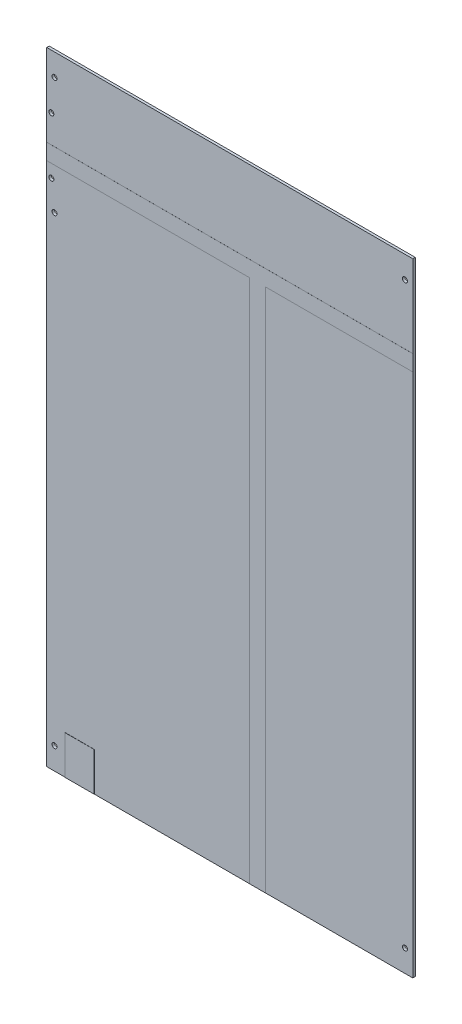
ISO-10303-21;
HEADER;
FILE_DESCRIPTION(('STEP AP214'),'2;1');
FILE_NAME('part.step','',(''),(''),'','','');
FILE_SCHEMA(('AUTOMOTIVE_DESIGN { 1 0 10303 214 1 1 1 1 }'));
ENDSEC;
DATA;
#1=APPLICATION_CONTEXT('core data for automotive mechanical design processes');
#2=APPLICATION_PROTOCOL_DEFINITION('international standard','automotive_design',2000,#1);
#3=PRODUCT_CONTEXT('',#1,'mechanical');
#4=PRODUCT('Part','Part','',(#3));
#5=PRODUCT_RELATED_PRODUCT_CATEGORY('part','',(#4));
#6=PRODUCT_DEFINITION_FORMATION('','',#4);
#7=PRODUCT_DEFINITION_CONTEXT('part definition',#1,'design');
#8=PRODUCT_DEFINITION('design','',#6,#7);
#9=PRODUCT_DEFINITION_SHAPE('','',#8);
#10=(LENGTH_UNIT() NAMED_UNIT(*) SI_UNIT(.MILLI.,.METRE.));
#11=(NAMED_UNIT(*) PLANE_ANGLE_UNIT() SI_UNIT($,.RADIAN.));
#12=(NAMED_UNIT(*) SI_UNIT($,.STERADIAN.) SOLID_ANGLE_UNIT());
#13=UNCERTAINTY_MEASURE_WITH_UNIT(LENGTH_MEASURE(1.E-05),#10,'distance_accuracy_value','');
#14=(GEOMETRIC_REPRESENTATION_CONTEXT(3) GLOBAL_UNCERTAINTY_ASSIGNED_CONTEXT((#13)) GLOBAL_UNIT_ASSIGNED_CONTEXT((#10,
#11,#12)) REPRESENTATION_CONTEXT('',''));
#15=CARTESIAN_POINT('',(0.,0.,0.));
#16=DIRECTION('',(0.,0.,1.));
#17=DIRECTION('',(1.,0.,0.));
#18=AXIS2_PLACEMENT_3D('',#15,#16,#17);
#19=CARTESIAN_POINT('',(0.,0.,1.5875));
#20=DIRECTION('',(0.,0.,1.));
#21=DIRECTION('',(1.,0.,0.));
#22=AXIS2_PLACEMENT_3D('',#19,#20,#21);
#23=PLANE('',#22);
#24=CARTESIAN_POINT('',(-112.2337,-31.486,1.5875));
#25=DIRECTION('',(0.,0.,1.));
#26=DIRECTION('',(1.,0.,0.));
#27=AXIS2_PLACEMENT_3D('',#24,#25,#26);
#28=CIRCLE('',#27,1.6);
#29=CARTESIAN_POINT('',(-110.6337,-31.486,1.5875));
#30=VERTEX_POINT('',#29);
#31=EDGE_CURVE('E485',#30,#30,#28,.T.);
#32=ORIENTED_EDGE('',*,*,#31,.F.);
#33=EDGE_LOOP('',(#32));
#34=FACE_BOUND('',#33,.T.);
#35=CARTESIAN_POINT('',(-114.2337,-13.33627,1.5875));
#36=DIRECTION('',(0.,0.,1.));
#37=DIRECTION('',(1.,0.,0.));
#38=AXIS2_PLACEMENT_3D('',#35,#36,#37);
#39=CIRCLE('',#38,1.6);
#40=CARTESIAN_POINT('',(-112.6337,-13.33627,1.5875));
#41=VERTEX_POINT('',#40);
#42=EDGE_CURVE('E478',#41,#41,#39,.T.);
#43=ORIENTED_EDGE('',*,*,#42,.F.);
#44=EDGE_LOOP('',(#43));
#45=FACE_BOUND('',#44,.T.);
#46=CARTESIAN_POINT('',(-112.2337,-327.1177,1.5875));
#47=DIRECTION('',(0.,0.,-1.));
#48=DIRECTION('',(-1.,0.,0.));
#49=AXIS2_PLACEMENT_3D('',#46,#47,#48);
#50=CIRCLE('',#49,1.6);
#51=CARTESIAN_POINT('',(-113.8337,-327.1177,1.5875));
#52=VERTEX_POINT('',#51);
#53=EDGE_CURVE('E235',#52,#52,#50,.T.);
#54=ORIENTED_EDGE('',*,*,#53,.T.);
#55=EDGE_LOOP('',(#54));
#56=FACE_BOUND('',#55,.T.);
#57=DIRECTION('',(1.,0.,0.));
#58=VECTOR('',#57,1.);
#59=CARTESIAN_POINT('',(-117.2337,-341.2617,1.5875));
#60=LINE('',#59,#58);
#61=CARTESIAN_POINT('',(-117.2337,-341.2617,1.5875));
#62=VERTEX_POINT('',#61);
#63=CARTESIAN_POINT('',(-105.294972818086,-341.2617,1.5875));
#64=VERTEX_POINT('',#63);
#65=EDGE_CURVE('E383',#62,#64,#60,.T.);
#66=ORIENTED_EDGE('',*,*,#65,.T.);
#67=DIRECTION('',(0.,-1.,0.));
#68=VECTOR('',#67,1.);
#69=CARTESIAN_POINT('',(-105.294972818086,-316.459595340702,1.5875));
#70=LINE('',#69,#68);
#71=CARTESIAN_POINT('',(-105.294972818086,-316.459595340702,1.5875));
#72=VERTEX_POINT('',#71);
#73=EDGE_CURVE('E232',#72,#64,#70,.T.);
#74=ORIENTED_EDGE('',*,*,#73,.F.);
#75=DIRECTION('',(-1.,0.,0.));
#76=VECTOR('',#75,1.);
#77=CARTESIAN_POINT('',(-86.7290271819139,-316.459595340702,1.5875));
#78=LINE('',#77,#76);
#79=CARTESIAN_POINT('',(-86.7290271819139,-316.459595340702,1.5875));
#80=VERTEX_POINT('',#79);
#81=EDGE_CURVE('E228',#80,#72,#78,.T.);
#82=ORIENTED_EDGE('',*,*,#81,.F.);
#83=DIRECTION('',(0.,1.,0.));
#84=VECTOR('',#83,1.);
#85=CARTESIAN_POINT('',(-86.7290271819139,-316.459595340702,1.5875));
#86=LINE('',#85,#84);
#87=CARTESIAN_POINT('',(-86.7290271819139,-341.2617,1.5875));
#88=VERTEX_POINT('',#87);
#89=EDGE_CURVE('E463',#88,#80,#86,.T.);
#90=ORIENTED_EDGE('',*,*,#89,.F.);
#91=CARTESIAN_POINT('',(12.827,-341.2617,1.5875));
#92=VERTEX_POINT('',#91);
#93=EDGE_CURVE('E387',#88,#92,#60,.T.);
#94=ORIENTED_EDGE('',*,*,#93,.T.);
#95=DIRECTION('',(0.,-1.,0.));
#96=VECTOR('',#95,1.);
#97=CARTESIAN_POINT('',(12.827,0.,1.5875));
#98=LINE('',#97,#96);
#99=CARTESIAN_POINT('',(12.827,-5.08,1.5875));
#100=VERTEX_POINT('',#99);
#101=EDGE_CURVE('E364',#100,#92,#98,.T.);
#102=ORIENTED_EDGE('',*,*,#101,.F.);
#103=DIRECTION('',(1.,0.,0.));
#104=VECTOR('',#103,1.);
#105=CARTESIAN_POINT('',(0.,-5.08,1.5875));
#106=LINE('',#105,#104);
#107=CARTESIAN_POINT('',(-117.2337,-5.08,1.5875));
#108=VERTEX_POINT('',#107);
#109=EDGE_CURVE('E328',#108,#100,#106,.T.);
#110=ORIENTED_EDGE('',*,*,#109,.F.);
#111=DIRECTION('',(0.,-1.,0.));
#112=VECTOR('',#111,1.);
#113=CARTESIAN_POINT('',(-117.2337,57.658,1.5875));
#114=LINE('',#113,#112);
#115=EDGE_CURVE('E382',#108,#62,#114,.T.);
#116=ORIENTED_EDGE('',*,*,#115,.T.);
#117=EDGE_LOOP('',(#66,#74,#82,#90,#94,#102,#110,#116));
#118=FACE_BOUND('',#117,.T.);
#119=ADVANCED_FACE('F41',(#34,#45,#56,#118),#23,.T.);
#120=CARTESIAN_POINT('',(-114.2337,22.85873,1.5875));
#121=DIRECTION('',(0.,0.,1.));
#122=DIRECTION('',(1.,0.,0.));
#123=AXIS2_PLACEMENT_3D('',#120,#121,#122);
#124=CIRCLE('',#123,1.6);
#125=CARTESIAN_POINT('',(-112.6337,22.85873,1.5875));
#126=VERTEX_POINT('',#125);
#127=EDGE_CURVE('E457',#126,#126,#124,.T.);
#128=ORIENTED_EDGE('',*,*,#127,.F.);
#129=EDGE_LOOP('',(#128));
#130=FACE_BOUND('',#129,.T.);
#131=CARTESIAN_POINT('',(-112.2337,43.514,1.5875));
#132=DIRECTION('',(0.,0.,-1.));
#133=DIRECTION('',(-1.,0.,0.));
#134=AXIS2_PLACEMENT_3D('',#131,#132,#133);
#135=CIRCLE('',#134,1.60000000000001);
#136=CARTESIAN_POINT('',(-113.8337,43.514,1.5875));
#137=VERTEX_POINT('',#136);
#138=EDGE_CURVE('E240',#137,#137,#135,.T.);
#139=ORIENTED_EDGE('',*,*,#138,.T.);
#140=EDGE_LOOP('',(#139));
#141=FACE_BOUND('',#140,.T.);
#142=CARTESIAN_POINT('',(112.2337,43.514,1.5875));
#143=DIRECTION('',(0.,0.,1.));
#144=DIRECTION('',(1.,0.,0.));
#145=AXIS2_PLACEMENT_3D('',#142,#143,#144);
#146=CIRCLE('',#145,1.60000000000001);
#147=CARTESIAN_POINT('',(113.8337,43.514,1.5875));
#148=VERTEX_POINT('',#147);
#149=EDGE_CURVE('E249',#148,#148,#146,.T.);
#150=ORIENTED_EDGE('',*,*,#149,.F.);
#151=EDGE_LOOP('',(#150));
#152=FACE_BOUND('',#151,.T.);
#153=DIRECTION('',(-1.,0.,0.));
#154=VECTOR('',#153,1.);
#155=CARTESIAN_POINT('',(0.,5.08,1.5875));
#156=LINE('',#155,#154);
#157=CARTESIAN_POINT('',(117.2337,5.08,1.5875));
#158=VERTEX_POINT('',#157);
#159=CARTESIAN_POINT('',(-117.2337,5.08,1.5875));
#160=VERTEX_POINT('',#159);
#161=EDGE_CURVE('E373',#158,#160,#156,.T.);
#162=ORIENTED_EDGE('',*,*,#161,.F.);
#163=DIRECTION('',(0.,1.,0.));
#164=VECTOR('',#163,1.);
#165=CARTESIAN_POINT('',(117.2337,57.658,1.5875));
#166=LINE('',#165,#164);
#167=CARTESIAN_POINT('',(117.2337,57.658,1.5875));
#168=VERTEX_POINT('',#167);
#169=EDGE_CURVE('E386',#158,#168,#166,.T.);
#170=ORIENTED_EDGE('',*,*,#169,.T.);
#171=DIRECTION('',(-1.,0.,0.));
#172=VECTOR('',#171,1.);
#173=CARTESIAN_POINT('',(-117.2337,57.658,1.5875));
#174=LINE('',#173,#172);
#175=CARTESIAN_POINT('',(-117.2337,57.658,1.5875));
#176=VERTEX_POINT('',#175);
#177=EDGE_CURVE('E391',#168,#176,#174,.T.);
#178=ORIENTED_EDGE('',*,*,#177,.T.);
#179=EDGE_CURVE('E378',#176,#160,#114,.T.);
#180=ORIENTED_EDGE('',*,*,#179,.T.);
#181=EDGE_LOOP('',(#162,#170,#178,#180));
#182=FACE_BOUND('',#181,.T.);
#183=ADVANCED_FACE('F508',(#130,#141,#152,#182),#23,.T.);
#184=CARTESIAN_POINT('',(112.2337,-327.1177,1.5875));
#185=DIRECTION('',(0.,0.,1.));
#186=DIRECTION('',(1.,0.,0.));
#187=AXIS2_PLACEMENT_3D('',#184,#185,#186);
#188=CIRCLE('',#187,1.6);
#189=CARTESIAN_POINT('',(113.8337,-327.1177,1.5875));
#190=VERTEX_POINT('',#189);
#191=EDGE_CURVE('E254',#190,#190,#188,.T.);
#192=ORIENTED_EDGE('',*,*,#191,.F.);
#193=EDGE_LOOP('',(#192));
#194=FACE_BOUND('',#193,.T.);
#195=DIRECTION('',(1.,0.,0.));
#196=VECTOR('',#195,1.);
#197=CARTESIAN_POINT('',(0.,-5.08000000000001,1.5875));
#198=LINE('',#197,#196);
#199=CARTESIAN_POINT('',(22.987,-5.08,1.5875));
#200=VERTEX_POINT('',#199);
#201=CARTESIAN_POINT('',(117.2337,-5.07999999999999,1.5875));
#202=VERTEX_POINT('',#201);
#203=EDGE_CURVE('E67',#200,#202,#198,.T.);
#204=ORIENTED_EDGE('',*,*,#203,.F.);
#205=DIRECTION('',(0.,1.,0.));
#206=VECTOR('',#205,1.);
#207=CARTESIAN_POINT('',(22.987,0.,1.5875));
#208=LINE('',#207,#206);
#209=CARTESIAN_POINT('',(22.987,-341.2617,1.5875));
#210=VERTEX_POINT('',#209);
#211=EDGE_CURVE('E368',#210,#200,#208,.T.);
#212=ORIENTED_EDGE('',*,*,#211,.F.);
#213=CARTESIAN_POINT('',(117.2337,-341.2617,1.5875));
#214=VERTEX_POINT('',#213);
#215=EDGE_CURVE('E381',#210,#214,#60,.T.);
#216=ORIENTED_EDGE('',*,*,#215,.T.);
#217=EDGE_CURVE('E388',#214,#202,#166,.T.);
#218=ORIENTED_EDGE('',*,*,#217,.T.);
#219=EDGE_LOOP('',(#204,#212,#216,#218));
#220=FACE_BOUND('',#219,.T.);
#221=ADVANCED_FACE('F511',(#194,#220),#23,.T.);
#222=CARTESIAN_POINT('',(0.,0.,0.));
#223=DIRECTION('',(0.,0.,1.));
#224=DIRECTION('',(1.,0.,0.));
#225=AXIS2_PLACEMENT_3D('',#222,#223,#224);
#226=PLANE('',#225);
#227=CARTESIAN_POINT('',(-114.2337,22.85873,0.));
#228=DIRECTION('',(0.,0.,1.));
#229=DIRECTION('',(1.,0.,0.));
#230=AXIS2_PLACEMENT_3D('',#227,#228,#229);
#231=CIRCLE('',#230,1.6);
#232=CARTESIAN_POINT('',(-112.6337,22.85873,0.));
#233=VERTEX_POINT('',#232);
#234=EDGE_CURVE('E456',#233,#233,#231,.T.);
#235=ORIENTED_EDGE('',*,*,#234,.T.);
#236=EDGE_LOOP('',(#235));
#237=FACE_BOUND('',#236,.T.);
#238=CARTESIAN_POINT('',(-112.2337,43.514,0.));
#239=DIRECTION('',(0.,0.,1.));
#240=DIRECTION('',(1.,0.,0.));
#241=AXIS2_PLACEMENT_3D('',#238,#239,#240);
#242=CIRCLE('',#241,1.60000000000001);
#243=CARTESIAN_POINT('',(-110.6337,43.514,0.));
#244=VERTEX_POINT('',#243);
#245=EDGE_CURVE('E258',#244,#244,#242,.F.);
#246=ORIENTED_EDGE('',*,*,#245,.F.);
#247=EDGE_LOOP('',(#246));
#248=FACE_BOUND('',#247,.T.);
#249=CARTESIAN_POINT('',(112.2337,43.514,0.));
#250=DIRECTION('',(0.,0.,1.));
#251=DIRECTION('',(1.,0.,0.));
#252=AXIS2_PLACEMENT_3D('',#249,#250,#251);
#253=CIRCLE('',#252,1.60000000000001);
#254=CARTESIAN_POINT('',(113.8337,43.514,0.));
#255=VERTEX_POINT('',#254);
#256=EDGE_CURVE('E264',#255,#255,#253,.T.);
#257=ORIENTED_EDGE('',*,*,#256,.T.);
#258=EDGE_LOOP('',(#257));
#259=FACE_BOUND('',#258,.T.);
#260=DIRECTION('',(0.,1.,0.));
#261=VECTOR('',#260,1.);
#262=CARTESIAN_POINT('',(117.2337,57.658,0.));
#263=LINE('',#262,#261);
#264=CARTESIAN_POINT('',(117.2337,5.08,0.));
#265=VERTEX_POINT('',#264);
#266=CARTESIAN_POINT('',(117.2337,57.658,0.));
#267=VERTEX_POINT('',#266);
#268=EDGE_CURVE('E403',#265,#267,#263,.T.);
#269=ORIENTED_EDGE('',*,*,#268,.F.);
#270=DIRECTION('',(-1.,0.,0.));
#271=VECTOR('',#270,1.);
#272=CARTESIAN_POINT('',(0.,5.08,0.));
#273=LINE('',#272,#271);
#274=CARTESIAN_POINT('',(-117.2337,5.08,0.));
#275=VERTEX_POINT('',#274);
#276=EDGE_CURVE('E11',#265,#275,#273,.T.);
#277=ORIENTED_EDGE('',*,*,#276,.T.);
#278=DIRECTION('',(0.,-1.,0.));
#279=VECTOR('',#278,1.);
#280=CARTESIAN_POINT('',(-117.2337,57.658,0.));
#281=LINE('',#280,#279);
#282=CARTESIAN_POINT('',(-117.2337,57.658,0.));
#283=VERTEX_POINT('',#282);
#284=EDGE_CURVE('E395',#283,#275,#281,.T.);
#285=ORIENTED_EDGE('',*,*,#284,.F.);
#286=DIRECTION('',(-1.,0.,0.));
#287=VECTOR('',#286,1.);
#288=CARTESIAN_POINT('',(-117.2337,57.658,0.));
#289=LINE('',#288,#287);
#290=EDGE_CURVE('E408',#267,#283,#289,.T.);
#291=ORIENTED_EDGE('',*,*,#290,.F.);
#292=EDGE_LOOP('',(#269,#277,#285,#291));
#293=FACE_BOUND('',#292,.T.);
#294=ADVANCED_FACE('F520',(#237,#248,#259,#293),#226,.F.);
#295=CARTESIAN_POINT('',(112.2337,-327.1177,0.));
#296=DIRECTION('',(0.,0.,1.));
#297=DIRECTION('',(1.,0.,0.));
#298=AXIS2_PLACEMENT_3D('',#295,#296,#297);
#299=CIRCLE('',#298,1.6);
#300=CARTESIAN_POINT('',(113.8337,-327.1177,0.));
#301=VERTEX_POINT('',#300);
#302=EDGE_CURVE('E253',#301,#301,#299,.T.);
#303=ORIENTED_EDGE('',*,*,#302,.T.);
#304=EDGE_LOOP('',(#303));
#305=FACE_BOUND('',#304,.T.);
#306=DIRECTION('',(0.,1.,0.));
#307=VECTOR('',#306,1.);
#308=CARTESIAN_POINT('',(22.987,0.,0.));
#309=LINE('',#308,#307);
#310=CARTESIAN_POINT('',(22.987,-341.2617,0.));
#311=VERTEX_POINT('',#310);
#312=CARTESIAN_POINT('',(22.987,-5.08,0.));
#313=VERTEX_POINT('',#312);
#314=EDGE_CURVE('E434',#311,#313,#309,.T.);
#315=ORIENTED_EDGE('',*,*,#314,.T.);
#316=DIRECTION('',(1.,0.,0.));
#317=VECTOR('',#316,1.);
#318=CARTESIAN_POINT('',(0.,-5.08000000000001,0.));
#319=LINE('',#318,#317);
#320=CARTESIAN_POINT('',(117.2337,-5.07999999999997,0.));
#321=VERTEX_POINT('',#320);
#322=EDGE_CURVE('E51',#313,#321,#319,.T.);
#323=ORIENTED_EDGE('',*,*,#322,.T.);
#324=CARTESIAN_POINT('',(117.2337,-341.2617,0.));
#325=VERTEX_POINT('',#324);
#326=EDGE_CURVE('E404',#325,#321,#263,.T.);
#327=ORIENTED_EDGE('',*,*,#326,.F.);
#328=DIRECTION('',(1.,0.,0.));
#329=VECTOR('',#328,1.);
#330=CARTESIAN_POINT('',(-117.2337,-341.2617,0.));
#331=LINE('',#330,#329);
#332=EDGE_CURVE('E399',#311,#325,#331,.T.);
#333=ORIENTED_EDGE('',*,*,#332,.F.);
#334=EDGE_LOOP('',(#315,#323,#327,#333));
#335=FACE_BOUND('',#334,.T.);
#336=ADVANCED_FACE('F525',(#305,#335),#226,.F.);
#337=CARTESIAN_POINT('',(-117.2337,57.658,1.5875));
#338=DIRECTION('',(1.,0.,0.));
#339=DIRECTION('',(0.,1.,0.));
#340=AXIS2_PLACEMENT_3D('',#337,#338,#339);
#341=PLANE('',#340);
#342=ORIENTED_EDGE('',*,*,#115,.F.);
#343=DIRECTION('',(0.,0.,1.));
#344=VECTOR('',#343,1.);
#345=CARTESIAN_POINT('',(-117.2337,-5.08,-0.0379000000000002));
#346=LINE('',#345,#344);
#347=CARTESIAN_POINT('',(-117.2337,-5.08,1.6129));
#348=VERTEX_POINT('',#347);
#349=EDGE_CURVE('E324',#108,#348,#346,.T.);
#350=ORIENTED_EDGE('',*,*,#349,.T.);
#351=DIRECTION('',(0.,-1.,0.));
#352=VECTOR('',#351,1.);
#353=CARTESIAN_POINT('',(-117.2337,5.08,1.6129));
#354=LINE('',#353,#352);
#355=CARTESIAN_POINT('',(-117.2337,5.08,1.6129));
#356=VERTEX_POINT('',#355);
#357=EDGE_CURVE('E259',#356,#348,#354,.T.);
#358=ORIENTED_EDGE('',*,*,#357,.F.);
#359=DIRECTION('',(0.,0.,1.));
#360=VECTOR('',#359,1.);
#361=CARTESIAN_POINT('',(-117.2337,5.08,-0.0379000000000002));
#362=LINE('',#361,#360);
#363=EDGE_CURVE('E329',#160,#356,#362,.T.);
#364=ORIENTED_EDGE('',*,*,#363,.F.);
#365=ORIENTED_EDGE('',*,*,#179,.F.);
#366=DIRECTION('',(0.,0.,-1.));
#367=VECTOR('',#366,1.);
#368=CARTESIAN_POINT('',(-117.2337,57.658,1.5875));
#369=LINE('',#368,#367);
#370=EDGE_CURVE('E394',#176,#283,#369,.T.);
#371=ORIENTED_EDGE('',*,*,#370,.T.);
#372=ORIENTED_EDGE('',*,*,#284,.T.);
#373=CARTESIAN_POINT('',(-117.2337,5.08,-0.0379000000000002));
#374=VERTEX_POINT('',#373);
#375=EDGE_CURVE('E325',#374,#275,#362,.T.);
#376=ORIENTED_EDGE('',*,*,#375,.F.);
#377=DIRECTION('',(0.,-1.,0.));
#378=VECTOR('',#377,1.);
#379=CARTESIAN_POINT('',(-117.2337,5.08,-0.0379000000000002));
#380=LINE('',#379,#378);
#381=CARTESIAN_POINT('',(-117.2337,-5.08,-0.0379000000000002));
#382=VERTEX_POINT('',#381);
#383=EDGE_CURVE('E292',#374,#382,#380,.T.);
#384=ORIENTED_EDGE('',*,*,#383,.T.);
#385=CARTESIAN_POINT('',(-117.2337,-5.08,0.));
#386=VERTEX_POINT('',#385);
#387=EDGE_CURVE('E357',#382,#386,#346,.T.);
#388=ORIENTED_EDGE('',*,*,#387,.T.);
#389=CARTESIAN_POINT('',(-117.2337,-341.2617,0.));
#390=VERTEX_POINT('',#389);
#391=EDGE_CURVE('E377',#386,#390,#281,.T.);
#392=ORIENTED_EDGE('',*,*,#391,.T.);
#393=DIRECTION('',(0.,0.,-1.));
#394=VECTOR('',#393,1.);
#395=CARTESIAN_POINT('',(-117.2337,-341.2617,1.5875));
#396=LINE('',#395,#394);
#397=EDGE_CURVE('E422',#62,#390,#396,.T.);
#398=ORIENTED_EDGE('',*,*,#397,.F.);
#399=EDGE_LOOP('',(#342,#350,#358,#364,#365,#371,#372,#376,#384,#388,#392,#398));
#400=FACE_BOUND('',#399,.T.);
#401=ADVANCED_FACE('F43',(#400),#341,.F.);
#402=CARTESIAN_POINT('',(-117.2337,-341.2617,1.5875));
#403=DIRECTION('',(0.,1.,0.));
#404=DIRECTION('',(0.,0.,1.));
#405=AXIS2_PLACEMENT_3D('',#402,#403,#404);
#406=PLANE('',#405);
#407=CARTESIAN_POINT('',(12.827,-341.2617,0.));
#408=VERTEX_POINT('',#407);
#409=EDGE_CURVE('E400',#390,#408,#331,.T.);
#410=ORIENTED_EDGE('',*,*,#409,.T.);
#411=DIRECTION('',(0.,0.,1.));
#412=VECTOR('',#411,1.);
#413=CARTESIAN_POINT('',(12.827,-341.2617,-0.0379000000000002));
#414=LINE('',#413,#412);
#415=CARTESIAN_POINT('',(12.827,-341.2617,-0.0379000000000002));
#416=VERTEX_POINT('',#415);
#417=EDGE_CURVE('E349',#416,#408,#414,.T.);
#418=ORIENTED_EDGE('',*,*,#417,.F.);
#419=DIRECTION('',(1.,0.,0.));
#420=VECTOR('',#419,1.);
#421=CARTESIAN_POINT('',(12.827,-341.2617,-0.0379000000000002));
#422=LINE('',#421,#420);
#423=CARTESIAN_POINT('',(22.987,-341.2617,-0.0379000000000002));
#424=VERTEX_POINT('',#423);
#425=EDGE_CURVE('E304',#416,#424,#422,.T.);
#426=ORIENTED_EDGE('',*,*,#425,.T.);
#427=DIRECTION('',(0.,0.,1.));
#428=VECTOR('',#427,1.);
#429=CARTESIAN_POINT('',(22.987,-341.2617,-0.0379000000000002));
#430=LINE('',#429,#428);
#431=EDGE_CURVE('E344',#424,#311,#430,.T.);
#432=ORIENTED_EDGE('',*,*,#431,.T.);
#433=ORIENTED_EDGE('',*,*,#332,.T.);
#434=DIRECTION('',(0.,0.,-1.));
#435=VECTOR('',#434,1.);
#436=CARTESIAN_POINT('',(117.2337,-341.2617,1.5875));
#437=LINE('',#436,#435);
#438=EDGE_CURVE('E418',#214,#325,#437,.T.);
#439=ORIENTED_EDGE('',*,*,#438,.F.);
#440=ORIENTED_EDGE('',*,*,#215,.F.);
#441=CARTESIAN_POINT('',(22.987,-341.2617,1.6129));
#442=VERTEX_POINT('',#441);
#443=EDGE_CURVE('E348',#210,#442,#430,.T.);
#444=ORIENTED_EDGE('',*,*,#443,.T.);
#445=DIRECTION('',(1.,0.,0.));
#446=VECTOR('',#445,1.);
#447=CARTESIAN_POINT('',(12.827,-341.2617,1.6129));
#448=LINE('',#447,#446);
#449=CARTESIAN_POINT('',(12.827,-341.2617,1.6129));
#450=VERTEX_POINT('',#449);
#451=EDGE_CURVE('E272',#450,#442,#448,.T.);
#452=ORIENTED_EDGE('',*,*,#451,.F.);
#453=EDGE_CURVE('E352',#92,#450,#414,.T.);
#454=ORIENTED_EDGE('',*,*,#453,.F.);
#455=ORIENTED_EDGE('',*,*,#93,.F.);
#456=DIRECTION('',(0.,0.,-1.));
#457=VECTOR('',#456,1.);
#458=CARTESIAN_POINT('',(-86.7290271819139,-341.2617,1.6875));
#459=LINE('',#458,#457);
#460=CARTESIAN_POINT('',(-86.7290271819139,-341.2617,1.6875));
#461=VERTEX_POINT('',#460);
#462=EDGE_CURVE('E214',#461,#88,#459,.T.);
#463=ORIENTED_EDGE('',*,*,#462,.F.);
#464=DIRECTION('',(1.,0.,0.));
#465=VECTOR('',#464,1.);
#466=CARTESIAN_POINT('',(-86.7290271819139,-341.2617,1.6875));
#467=LINE('',#466,#465);
#468=CARTESIAN_POINT('',(-105.294972818086,-341.2617,1.6875));
#469=VERTEX_POINT('',#468);
#470=EDGE_CURVE('E205',#469,#461,#467,.T.);
#471=ORIENTED_EDGE('',*,*,#470,.F.);
#472=DIRECTION('',(0.,0.,-1.));
#473=VECTOR('',#472,1.);
#474=CARTESIAN_POINT('',(-105.294972818086,-341.2617,1.6875));
#475=LINE('',#474,#473);
#476=EDGE_CURVE('E211',#469,#64,#475,.T.);
#477=ORIENTED_EDGE('',*,*,#476,.T.);
#478=ORIENTED_EDGE('',*,*,#65,.F.);
#479=ORIENTED_EDGE('',*,*,#397,.T.);
#480=EDGE_LOOP('',(#410,#418,#426,#432,#433,#439,#440,#444,#452,#454,#455,#463,#471,#477,#478,#479));
#481=FACE_BOUND('',#480,.T.);
#482=ADVANCED_FACE('F208',(#481),#406,.F.);
#483=CARTESIAN_POINT('',(117.2337,57.658,1.5875));
#484=DIRECTION('',(-1.,0.,0.));
#485=DIRECTION('',(0.,-1.,0.));
#486=AXIS2_PLACEMENT_3D('',#483,#484,#485);
#487=PLANE('',#486);
#488=ORIENTED_EDGE('',*,*,#326,.T.);
#489=DIRECTION('',(0.,0.,1.));
#490=VECTOR('',#489,1.);
#491=CARTESIAN_POINT('',(117.2337,-5.07999999999997,-0.0379000000000002));
#492=LINE('',#491,#490);
#493=CARTESIAN_POINT('',(117.2337,-5.07999999999997,-0.0379000000000002));
#494=VERTEX_POINT('',#493);
#495=EDGE_CURVE('E335',#494,#321,#492,.T.);
#496=ORIENTED_EDGE('',*,*,#495,.F.);
#497=DIRECTION('',(0.,1.,0.));
#498=VECTOR('',#497,1.);
#499=CARTESIAN_POINT('',(117.2337,5.08,-0.0379000000000002));
#500=LINE('',#499,#498);
#501=CARTESIAN_POINT('',(117.2337,5.08,-0.0379000000000002));
#502=VERTEX_POINT('',#501);
#503=EDGE_CURVE('E316',#494,#502,#500,.T.);
#504=ORIENTED_EDGE('',*,*,#503,.T.);
#505=DIRECTION('',(0.,0.,1.));
#506=VECTOR('',#505,1.);
#507=CARTESIAN_POINT('',(117.2337,5.08,-0.0379000000000002));
#508=LINE('',#507,#506);
#509=EDGE_CURVE('E330',#502,#265,#508,.T.);
#510=ORIENTED_EDGE('',*,*,#509,.T.);
#511=ORIENTED_EDGE('',*,*,#268,.T.);
#512=DIRECTION('',(0.,0.,-1.));
#513=VECTOR('',#512,1.);
#514=CARTESIAN_POINT('',(117.2337,57.658,1.5875));
#515=LINE('',#514,#513);
#516=EDGE_CURVE('E414',#168,#267,#515,.T.);
#517=ORIENTED_EDGE('',*,*,#516,.F.);
#518=ORIENTED_EDGE('',*,*,#169,.F.);
#519=CARTESIAN_POINT('',(117.2337,5.08,1.6129));
#520=VERTEX_POINT('',#519);
#521=EDGE_CURVE('E334',#158,#520,#508,.T.);
#522=ORIENTED_EDGE('',*,*,#521,.T.);
#523=DIRECTION('',(0.,1.,0.));
#524=VECTOR('',#523,1.);
#525=CARTESIAN_POINT('',(117.2337,5.08,1.6129));
#526=LINE('',#525,#524);
#527=CARTESIAN_POINT('',(117.2337,-5.07999999999997,1.6129));
#528=VERTEX_POINT('',#527);
#529=EDGE_CURVE('E284',#528,#520,#526,.T.);
#530=ORIENTED_EDGE('',*,*,#529,.F.);
#531=EDGE_CURVE('E338',#202,#528,#492,.T.);
#532=ORIENTED_EDGE('',*,*,#531,.F.);
#533=ORIENTED_EDGE('',*,*,#217,.F.);
#534=ORIENTED_EDGE('',*,*,#438,.T.);
#535=EDGE_LOOP('',(#488,#496,#504,#510,#511,#517,#518,#522,#530,#532,#533,#534));
#536=FACE_BOUND('',#535,.T.);
#537=ADVANCED_FACE('F601',(#536),#487,.F.);
#538=CARTESIAN_POINT('',(-117.2337,57.658,1.5875));
#539=DIRECTION('',(0.,-1.,0.));
#540=DIRECTION('',(0.,0.,-1.));
#541=AXIS2_PLACEMENT_3D('',#538,#539,#540);
#542=PLANE('',#541);
#543=ORIENTED_EDGE('',*,*,#290,.T.);
#544=ORIENTED_EDGE('',*,*,#370,.F.);
#545=ORIENTED_EDGE('',*,*,#177,.F.);
#546=ORIENTED_EDGE('',*,*,#516,.T.);
#547=EDGE_LOOP('',(#543,#544,#545,#546));
#548=FACE_BOUND('',#547,.T.);
#549=ADVANCED_FACE('F600',(#548),#542,.F.);
#550=CARTESIAN_POINT('',(-112.2337,-31.486,0.));
#551=DIRECTION('',(0.,0.,1.));
#552=DIRECTION('',(1.,0.,0.));
#553=AXIS2_PLACEMENT_3D('',#550,#551,#552);
#554=CIRCLE('',#553,1.6);
#555=CARTESIAN_POINT('',(-110.6337,-31.486,0.));
#556=VERTEX_POINT('',#555);
#557=EDGE_CURVE('E45',#556,#556,#554,.T.);
#558=ORIENTED_EDGE('',*,*,#557,.T.);
#559=EDGE_LOOP('',(#558));
#560=FACE_BOUND('',#559,.T.);
#561=CARTESIAN_POINT('',(-114.2337,-13.33627,0.));
#562=DIRECTION('',(0.,0.,1.));
#563=DIRECTION('',(1.,0.,0.));
#564=AXIS2_PLACEMENT_3D('',#561,#562,#563);
#565=CIRCLE('',#564,1.6);
#566=CARTESIAN_POINT('',(-112.6337,-13.33627,0.));
#567=VERTEX_POINT('',#566);
#568=EDGE_CURVE('E453',#567,#567,#565,.T.);
#569=ORIENTED_EDGE('',*,*,#568,.T.);
#570=EDGE_LOOP('',(#569));
#571=FACE_BOUND('',#570,.T.);
#572=CARTESIAN_POINT('',(-112.2337,-327.1177,0.));
#573=DIRECTION('',(0.,0.,1.));
#574=DIRECTION('',(1.,0.,0.));
#575=AXIS2_PLACEMENT_3D('',#572,#573,#574);
#576=CIRCLE('',#575,1.6);
#577=CARTESIAN_POINT('',(-110.6337,-327.1177,0.));
#578=VERTEX_POINT('',#577);
#579=EDGE_CURVE('E247',#578,#578,#576,.F.);
#580=ORIENTED_EDGE('',*,*,#579,.F.);
#581=EDGE_LOOP('',(#580));
#582=FACE_BOUND('',#581,.T.);
#583=DIRECTION('',(1.,0.,0.));
#584=VECTOR('',#583,1.);
#585=CARTESIAN_POINT('',(0.,-5.08,0.));
#586=LINE('',#585,#584);
#587=CARTESIAN_POINT('',(12.827,-5.08,0.));
#588=VERTEX_POINT('',#587);
#589=EDGE_CURVE('E426',#386,#588,#586,.T.);
#590=ORIENTED_EDGE('',*,*,#589,.T.);
#591=DIRECTION('',(0.,-1.,0.));
#592=VECTOR('',#591,1.);
#593=CARTESIAN_POINT('',(12.827,0.,0.));
#594=LINE('',#593,#592);
#595=EDGE_CURVE('E430',#588,#408,#594,.T.);
#596=ORIENTED_EDGE('',*,*,#595,.T.);
#597=ORIENTED_EDGE('',*,*,#409,.F.);
#598=ORIENTED_EDGE('',*,*,#391,.F.);
#599=EDGE_LOOP('',(#590,#596,#597,#598));
#600=FACE_BOUND('',#599,.T.);
#601=ADVANCED_FACE('F494',(#560,#571,#582,#600),#226,.F.);
#602=CARTESIAN_POINT('',(0.,0.,-0.0379000000000002));
#603=DIRECTION('',(0.,0.,1.));
#604=DIRECTION('',(1.,0.,0.));
#605=AXIS2_PLACEMENT_3D('',#602,#603,#604);
#606=PLANE('',#605);
#607=ORIENTED_EDGE('',*,*,#383,.F.);
#608=DIRECTION('',(-1.,0.,0.));
#609=VECTOR('',#608,1.);
#610=CARTESIAN_POINT('',(-117.2337,5.08,-0.0379000000000002));
#611=LINE('',#610,#609);
#612=EDGE_CURVE('E320',#502,#374,#611,.T.);
#613=ORIENTED_EDGE('',*,*,#612,.F.);
#614=ORIENTED_EDGE('',*,*,#503,.F.);
#615=DIRECTION('',(1.,0.,0.));
#616=VECTOR('',#615,1.);
#617=CARTESIAN_POINT('',(22.987,-5.08,-0.0379000000000002));
#618=LINE('',#617,#616);
#619=CARTESIAN_POINT('',(22.987,-5.08,-0.0379000000000002));
#620=VERTEX_POINT('',#619);
#621=EDGE_CURVE('E312',#620,#494,#618,.T.);
#622=ORIENTED_EDGE('',*,*,#621,.F.);
#623=DIRECTION('',(0.,1.,0.));
#624=VECTOR('',#623,1.);
#625=CARTESIAN_POINT('',(22.987,-5.08,-0.0379000000000002));
#626=LINE('',#625,#624);
#627=EDGE_CURVE('E308',#424,#620,#626,.T.);
#628=ORIENTED_EDGE('',*,*,#627,.F.);
#629=ORIENTED_EDGE('',*,*,#425,.F.);
#630=DIRECTION('',(0.,-1.,0.));
#631=VECTOR('',#630,1.);
#632=CARTESIAN_POINT('',(12.827,-5.08,-0.0379000000000002));
#633=LINE('',#632,#631);
#634=CARTESIAN_POINT('',(12.827,-5.08,-0.0379000000000002));
#635=VERTEX_POINT('',#634);
#636=EDGE_CURVE('E300',#635,#416,#633,.T.);
#637=ORIENTED_EDGE('',*,*,#636,.F.);
#638=DIRECTION('',(1.,0.,0.));
#639=VECTOR('',#638,1.);
#640=CARTESIAN_POINT('',(-117.2337,-5.08,-0.0379000000000002));
#641=LINE('',#640,#639);
#642=EDGE_CURVE('E296',#382,#635,#641,.T.);
#643=ORIENTED_EDGE('',*,*,#642,.F.);
#644=EDGE_LOOP('',(#607,#613,#614,#622,#628,#629,#637,#643));
#645=FACE_BOUND('',#644,.T.);
#646=ADVANCED_FACE('F548',(#645),#606,.F.);
#647=CARTESIAN_POINT('',(-117.2337,-5.08,-0.0379000000000002));
#648=DIRECTION('',(0.,-1.,0.));
#649=DIRECTION('',(1.,0.,0.));
#650=AXIS2_PLACEMENT_3D('',#647,#648,#649);
#651=PLANE('',#650);
#652=ORIENTED_EDGE('',*,*,#589,.F.);
#653=ORIENTED_EDGE('',*,*,#387,.F.);
#654=ORIENTED_EDGE('',*,*,#642,.T.);
#655=DIRECTION('',(0.,0.,1.));
#656=VECTOR('',#655,1.);
#657=CARTESIAN_POINT('',(12.827,-5.08,-0.0379000000000002));
#658=LINE('',#657,#656);
#659=EDGE_CURVE('E353',#635,#588,#658,.T.);
#660=ORIENTED_EDGE('',*,*,#659,.T.);
#661=EDGE_LOOP('',(#652,#653,#654,#660));
#662=FACE_BOUND('',#661,.T.);
#663=ADVANCED_FACE('F555',(#662),#651,.T.);
#664=CARTESIAN_POINT('',(12.827,-5.08,-0.0379000000000002));
#665=DIRECTION('',(-1.,0.,0.));
#666=DIRECTION('',(0.,-1.,0.));
#667=AXIS2_PLACEMENT_3D('',#664,#665,#666);
#668=PLANE('',#667);
#669=ORIENTED_EDGE('',*,*,#595,.F.);
#670=ORIENTED_EDGE('',*,*,#659,.F.);
#671=ORIENTED_EDGE('',*,*,#636,.T.);
#672=ORIENTED_EDGE('',*,*,#417,.T.);
#673=EDGE_LOOP('',(#669,#670,#671,#672));
#674=FACE_BOUND('',#673,.T.);
#675=ADVANCED_FACE('F553',(#674),#668,.T.);
#676=CARTESIAN_POINT('',(22.987,-5.08,-0.0379000000000002));
#677=DIRECTION('',(1.,0.,0.));
#678=DIRECTION('',(0.,1.,0.));
#679=AXIS2_PLACEMENT_3D('',#676,#677,#678);
#680=PLANE('',#679);
#681=ORIENTED_EDGE('',*,*,#314,.F.);
#682=ORIENTED_EDGE('',*,*,#431,.F.);
#683=ORIENTED_EDGE('',*,*,#627,.T.);
#684=DIRECTION('',(0.,0.,1.));
#685=VECTOR('',#684,1.);
#686=CARTESIAN_POINT('',(22.987,-5.08,-0.0379000000000002));
#687=LINE('',#686,#685);
#688=EDGE_CURVE('E339',#620,#313,#687,.T.);
#689=ORIENTED_EDGE('',*,*,#688,.T.);
#690=EDGE_LOOP('',(#681,#682,#683,#689));
#691=FACE_BOUND('',#690,.T.);
#692=ADVANCED_FACE('F541',(#691),#680,.T.);
#693=CARTESIAN_POINT('',(22.987,-5.08,-0.0379000000000002));
#694=DIRECTION('',(0.,-1.,0.));
#695=DIRECTION('',(1.,0.,0.));
#696=AXIS2_PLACEMENT_3D('',#693,#694,#695);
#697=PLANE('',#696);
#698=ORIENTED_EDGE('',*,*,#322,.F.);
#699=ORIENTED_EDGE('',*,*,#688,.F.);
#700=ORIENTED_EDGE('',*,*,#621,.T.);
#701=ORIENTED_EDGE('',*,*,#495,.T.);
#702=EDGE_LOOP('',(#698,#699,#700,#701));
#703=FACE_BOUND('',#702,.T.);
#704=ADVANCED_FACE('F748',(#703),#697,.T.);
#705=CARTESIAN_POINT('',(-117.2337,5.08,-0.0379000000000002));
#706=DIRECTION('',(0.,1.,0.));
#707=DIRECTION('',(-1.,0.,0.));
#708=AXIS2_PLACEMENT_3D('',#705,#706,#707);
#709=PLANE('',#708);
#710=ORIENTED_EDGE('',*,*,#276,.F.);
#711=ORIENTED_EDGE('',*,*,#509,.F.);
#712=ORIENTED_EDGE('',*,*,#612,.T.);
#713=ORIENTED_EDGE('',*,*,#375,.T.);
#714=EDGE_LOOP('',(#710,#711,#712,#713));
#715=FACE_BOUND('',#714,.T.);
#716=ADVANCED_FACE('F562',(#715),#709,.T.);
#717=ORIENTED_EDGE('',*,*,#521,.F.);
#718=ORIENTED_EDGE('',*,*,#161,.T.);
#719=ORIENTED_EDGE('',*,*,#363,.T.);
#720=DIRECTION('',(-1.,0.,0.));
#721=VECTOR('',#720,1.);
#722=CARTESIAN_POINT('',(-117.2337,5.08,1.6129));
#723=LINE('',#722,#721);
#724=EDGE_CURVE('E288',#520,#356,#723,.T.);
#725=ORIENTED_EDGE('',*,*,#724,.F.);
#726=EDGE_LOOP('',(#717,#718,#719,#725));
#727=FACE_BOUND('',#726,.T.);
#728=ADVANCED_FACE('F593',(#727),#709,.T.);
#729=CARTESIAN_POINT('',(22.987,-5.08,1.6129));
#730=VERTEX_POINT('',#729);
#731=EDGE_CURVE('E343',#200,#730,#687,.T.);
#732=ORIENTED_EDGE('',*,*,#731,.F.);
#733=ORIENTED_EDGE('',*,*,#203,.T.);
#734=ORIENTED_EDGE('',*,*,#531,.T.);
#735=DIRECTION('',(1.,0.,0.));
#736=VECTOR('',#735,1.);
#737=CARTESIAN_POINT('',(22.987,-5.08,1.6129));
#738=LINE('',#737,#736);
#739=EDGE_CURVE('E280',#730,#528,#738,.T.);
#740=ORIENTED_EDGE('',*,*,#739,.F.);
#741=EDGE_LOOP('',(#732,#733,#734,#740));
#742=FACE_BOUND('',#741,.T.);
#743=ADVANCED_FACE('F736',(#742),#697,.T.);
#744=ORIENTED_EDGE('',*,*,#443,.F.);
#745=ORIENTED_EDGE('',*,*,#211,.T.);
#746=ORIENTED_EDGE('',*,*,#731,.T.);
#747=DIRECTION('',(0.,1.,0.));
#748=VECTOR('',#747,1.);
#749=CARTESIAN_POINT('',(22.987,-5.08,1.6129));
#750=LINE('',#749,#748);
#751=EDGE_CURVE('E276',#442,#730,#750,.T.);
#752=ORIENTED_EDGE('',*,*,#751,.F.);
#753=EDGE_LOOP('',(#744,#745,#746,#752));
#754=FACE_BOUND('',#753,.T.);
#755=ADVANCED_FACE('F726',(#754),#680,.T.);
#756=CARTESIAN_POINT('',(12.827,-5.08,1.6129));
#757=VERTEX_POINT('',#756);
#758=EDGE_CURVE('E356',#100,#757,#658,.T.);
#759=ORIENTED_EDGE('',*,*,#758,.F.);
#760=ORIENTED_EDGE('',*,*,#101,.T.);
#761=ORIENTED_EDGE('',*,*,#453,.T.);
#762=DIRECTION('',(0.,-1.,0.));
#763=VECTOR('',#762,1.);
#764=CARTESIAN_POINT('',(12.827,-5.08,1.6129));
#765=LINE('',#764,#763);
#766=EDGE_CURVE('E268',#757,#450,#765,.T.);
#767=ORIENTED_EDGE('',*,*,#766,.F.);
#768=EDGE_LOOP('',(#759,#760,#761,#767));
#769=FACE_BOUND('',#768,.T.);
#770=ADVANCED_FACE('F718',(#769),#668,.T.);
#771=ORIENTED_EDGE('',*,*,#349,.F.);
#772=ORIENTED_EDGE('',*,*,#109,.T.);
#773=ORIENTED_EDGE('',*,*,#758,.T.);
#774=DIRECTION('',(1.,0.,0.));
#775=VECTOR('',#774,1.);
#776=CARTESIAN_POINT('',(-117.2337,-5.08,1.6129));
#777=LINE('',#776,#775);
#778=EDGE_CURVE('E263',#348,#757,#777,.T.);
#779=ORIENTED_EDGE('',*,*,#778,.F.);
#780=EDGE_LOOP('',(#771,#772,#773,#779));
#781=FACE_BOUND('',#780,.T.);
#782=ADVANCED_FACE('F585',(#781),#651,.T.);
#783=CARTESIAN_POINT('',(0.,0.,1.6129));
#784=DIRECTION('',(0.,0.,1.));
#785=DIRECTION('',(1.,0.,0.));
#786=AXIS2_PLACEMENT_3D('',#783,#784,#785);
#787=PLANE('',#786);
#788=ORIENTED_EDGE('',*,*,#357,.T.);
#789=ORIENTED_EDGE('',*,*,#778,.T.);
#790=ORIENTED_EDGE('',*,*,#766,.T.);
#791=ORIENTED_EDGE('',*,*,#451,.T.);
#792=ORIENTED_EDGE('',*,*,#751,.T.);
#793=ORIENTED_EDGE('',*,*,#739,.T.);
#794=ORIENTED_EDGE('',*,*,#529,.T.);
#795=ORIENTED_EDGE('',*,*,#724,.T.);
#796=EDGE_LOOP('',(#788,#789,#790,#791,#792,#793,#794,#795));
#797=FACE_BOUND('',#796,.T.);
#798=ADVANCED_FACE('F532',(#797),#787,.T.);
#799=CARTESIAN_POINT('',(112.2337,-327.1177,-0.0379000000000002));
#800=DIRECTION('',(0.,0.,1.));
#801=DIRECTION('',(1.,0.,0.));
#802=AXIS2_PLACEMENT_3D('',#799,#800,#801);
#803=CYLINDRICAL_SURFACE('',#802,1.6);
#804=ORIENTED_EDGE('',*,*,#191,.T.);
#805=EDGE_LOOP('',(#804));
#806=FACE_BOUND('',#805,.T.);
#807=ORIENTED_EDGE('',*,*,#302,.F.);
#808=EDGE_LOOP('',(#807));
#809=FACE_BOUND('',#808,.T.);
#810=ADVANCED_FACE('F528',(#806,#809),#803,.F.);
#811=CARTESIAN_POINT('',(112.2337,43.514,-0.0379000000000002));
#812=DIRECTION('',(0.,0.,1.));
#813=DIRECTION('',(1.,0.,0.));
#814=AXIS2_PLACEMENT_3D('',#811,#812,#813);
#815=CYLINDRICAL_SURFACE('',#814,1.60000000000001);
#816=ORIENTED_EDGE('',*,*,#149,.T.);
#817=EDGE_LOOP('',(#816));
#818=FACE_BOUND('',#817,.T.);
#819=ORIENTED_EDGE('',*,*,#256,.F.);
#820=EDGE_LOOP('',(#819));
#821=FACE_BOUND('',#820,.T.);
#822=ADVANCED_FACE('F531',(#818,#821),#815,.F.);
#823=CARTESIAN_POINT('',(-112.2337,-327.1177,-0.0379000000000002));
#824=DIRECTION('',(0.,0.,1.));
#825=DIRECTION('',(1.,0.,0.));
#826=AXIS2_PLACEMENT_3D('',#823,#824,#825);
#827=CYLINDRICAL_SURFACE('',#826,1.6);
#828=ORIENTED_EDGE('',*,*,#53,.F.);
#829=EDGE_LOOP('',(#828));
#830=FACE_BOUND('',#829,.T.);
#831=ORIENTED_EDGE('',*,*,#579,.T.);
#832=EDGE_LOOP('',(#831));
#833=FACE_BOUND('',#832,.T.);
#834=ADVANCED_FACE('F806',(#830,#833),#827,.F.);
#835=CARTESIAN_POINT('',(-112.2337,43.514,-0.0379000000000002));
#836=DIRECTION('',(0.,0.,1.));
#837=DIRECTION('',(1.,0.,0.));
#838=AXIS2_PLACEMENT_3D('',#835,#836,#837);
#839=CYLINDRICAL_SURFACE('',#838,1.60000000000001);
#840=ORIENTED_EDGE('',*,*,#138,.F.);
#841=EDGE_LOOP('',(#840));
#842=FACE_BOUND('',#841,.T.);
#843=ORIENTED_EDGE('',*,*,#245,.T.);
#844=EDGE_LOOP('',(#843));
#845=FACE_BOUND('',#844,.T.);
#846=ADVANCED_FACE('F810',(#842,#845),#839,.F.);
#847=CARTESIAN_POINT('',(-105.294972818086,-316.459595340702,1.6875));
#848=DIRECTION('',(1.,0.,0.));
#849=DIRECTION('',(0.,0.,-1.));
#850=AXIS2_PLACEMENT_3D('',#847,#848,#849);
#851=PLANE('',#850);
#852=ORIENTED_EDGE('',*,*,#73,.T.);
#853=ORIENTED_EDGE('',*,*,#476,.F.);
#854=DIRECTION('',(0.,-1.,0.));
#855=VECTOR('',#854,1.);
#856=CARTESIAN_POINT('',(-105.294972818086,-316.459595340702,1.6875));
#857=LINE('',#856,#855);
#858=CARTESIAN_POINT('',(-105.294972818086,-316.459595340702,1.6875));
#859=VERTEX_POINT('',#858);
#860=EDGE_CURVE('E219',#859,#469,#857,.T.);
#861=ORIENTED_EDGE('',*,*,#860,.F.);
#862=DIRECTION('',(0.,0.,-1.));
#863=VECTOR('',#862,1.);
#864=CARTESIAN_POINT('',(-105.294972818086,-316.459595340702,1.6875));
#865=LINE('',#864,#863);
#866=EDGE_CURVE('E472',#859,#72,#865,.T.);
#867=ORIENTED_EDGE('',*,*,#866,.T.);
#868=EDGE_LOOP('',(#852,#853,#861,#867));
#869=FACE_BOUND('',#868,.T.);
#870=ADVANCED_FACE('F230',(#869),#851,.F.);
#871=CARTESIAN_POINT('',(-86.7290271819139,-316.459595340702,1.6875));
#872=DIRECTION('',(-1.,0.,0.));
#873=DIRECTION('',(0.,0.,1.));
#874=AXIS2_PLACEMENT_3D('',#871,#872,#873);
#875=PLANE('',#874);
#876=ORIENTED_EDGE('',*,*,#89,.T.);
#877=DIRECTION('',(0.,0.,-1.));
#878=VECTOR('',#877,1.);
#879=CARTESIAN_POINT('',(-86.7290271819139,-316.459595340702,1.6875));
#880=LINE('',#879,#878);
#881=CARTESIAN_POINT('',(-86.7290271819139,-316.459595340702,1.6875));
#882=VERTEX_POINT('',#881);
#883=EDGE_CURVE('E59',#882,#80,#880,.T.);
#884=ORIENTED_EDGE('',*,*,#883,.F.);
#885=DIRECTION('',(0.,1.,0.));
#886=VECTOR('',#885,1.);
#887=CARTESIAN_POINT('',(-86.7290271819139,-316.459595340702,1.6875));
#888=LINE('',#887,#886);
#889=EDGE_CURVE('E218',#461,#882,#888,.T.);
#890=ORIENTED_EDGE('',*,*,#889,.F.);
#891=ORIENTED_EDGE('',*,*,#462,.T.);
#892=EDGE_LOOP('',(#876,#884,#890,#891));
#893=FACE_BOUND('',#892,.T.);
#894=ADVANCED_FACE('F817',(#893),#875,.F.);
#895=CARTESIAN_POINT('',(-86.7290271819139,-316.459595340702,1.6875));
#896=DIRECTION('',(0.,-1.,0.));
#897=DIRECTION('',(0.,0.,-1.));
#898=AXIS2_PLACEMENT_3D('',#895,#896,#897);
#899=PLANE('',#898);
#900=ORIENTED_EDGE('',*,*,#81,.T.);
#901=ORIENTED_EDGE('',*,*,#866,.F.);
#902=DIRECTION('',(-1.,0.,0.));
#903=VECTOR('',#902,1.);
#904=CARTESIAN_POINT('',(-86.7290271819139,-316.459595340702,1.6875));
#905=LINE('',#904,#903);
#906=EDGE_CURVE('E223',#882,#859,#905,.T.);
#907=ORIENTED_EDGE('',*,*,#906,.F.);
#908=ORIENTED_EDGE('',*,*,#883,.T.);
#909=EDGE_LOOP('',(#900,#901,#907,#908));
#910=FACE_BOUND('',#909,.T.);
#911=ADVANCED_FACE('F820',(#910),#899,.F.);
#912=CARTESIAN_POINT('',(0.,0.,1.6875));
#913=DIRECTION('',(0.,0.,-1.));
#914=DIRECTION('',(-1.,0.,0.));
#915=AXIS2_PLACEMENT_3D('',#912,#913,#914);
#916=PLANE('',#915);
#917=ORIENTED_EDGE('',*,*,#860,.T.);
#918=ORIENTED_EDGE('',*,*,#470,.T.);
#919=ORIENTED_EDGE('',*,*,#889,.T.);
#920=ORIENTED_EDGE('',*,*,#906,.T.);
#921=EDGE_LOOP('',(#917,#918,#919,#920));
#922=FACE_BOUND('',#921,.T.);
#923=ADVANCED_FACE('F222',(#922),#916,.F.);
#924=CARTESIAN_POINT('',(-114.2337,-13.33627,-0.0379000000000002));
#925=DIRECTION('',(0.,0.,1.));
#926=DIRECTION('',(1.,0.,0.));
#927=AXIS2_PLACEMENT_3D('',#924,#925,#926);
#928=CYLINDRICAL_SURFACE('',#927,1.6);
#929=ORIENTED_EDGE('',*,*,#42,.T.);
#930=EDGE_LOOP('',(#929));
#931=FACE_BOUND('',#930,.T.);
#932=ORIENTED_EDGE('',*,*,#568,.F.);
#933=EDGE_LOOP('',(#932));
#934=FACE_BOUND('',#933,.T.);
#935=ADVANCED_FACE('F504',(#931,#934),#928,.F.);
#936=CARTESIAN_POINT('',(-114.2337,22.85873,-0.0379000000000002));
#937=DIRECTION('',(0.,0.,1.));
#938=DIRECTION('',(1.,0.,0.));
#939=AXIS2_PLACEMENT_3D('',#936,#937,#938);
#940=CYLINDRICAL_SURFACE('',#939,1.6);
#941=ORIENTED_EDGE('',*,*,#127,.T.);
#942=EDGE_LOOP('',(#941));
#943=FACE_BOUND('',#942,.T.);
#944=ORIENTED_EDGE('',*,*,#234,.F.);
#945=EDGE_LOOP('',(#944));
#946=FACE_BOUND('',#945,.T.);
#947=ADVANCED_FACE('F499',(#943,#946),#940,.F.);
#948=CARTESIAN_POINT('',(-112.2337,-31.486,-8.4125));
#949=DIRECTION('',(0.,0.,1.));
#950=DIRECTION('',(1.,0.,0.));
#951=AXIS2_PLACEMENT_3D('',#948,#949,#950);
#952=CYLINDRICAL_SURFACE('',#951,1.6);
#953=ORIENTED_EDGE('',*,*,#31,.T.);
#954=EDGE_LOOP('',(#953));
#955=FACE_BOUND('',#954,.T.);
#956=ORIENTED_EDGE('',*,*,#557,.F.);
#957=EDGE_LOOP('',(#956));
#958=FACE_BOUND('',#957,.T.);
#959=ADVANCED_FACE('F497',(#955,#958),#952,.F.);
#960=CLOSED_SHELL('',(#119,#183,#221,#294,#336,#401,#482,#537,#549,#601,#646,#663,#675,#692,
#704,#716,#728,#743,#755,#770,#782,#798,#810,#822,#834,#846,#870,#894,#911,#923,#935,#947,#959));
#961=MANIFOLD_SOLID_BREP('B2',#960);
#962=ADVANCED_BREP_SHAPE_REPRESENTATION('',(#18,#961),#14);
#963=SHAPE_DEFINITION_REPRESENTATION(#9,#962);
ENDSEC;
END-ISO-10303-21;
